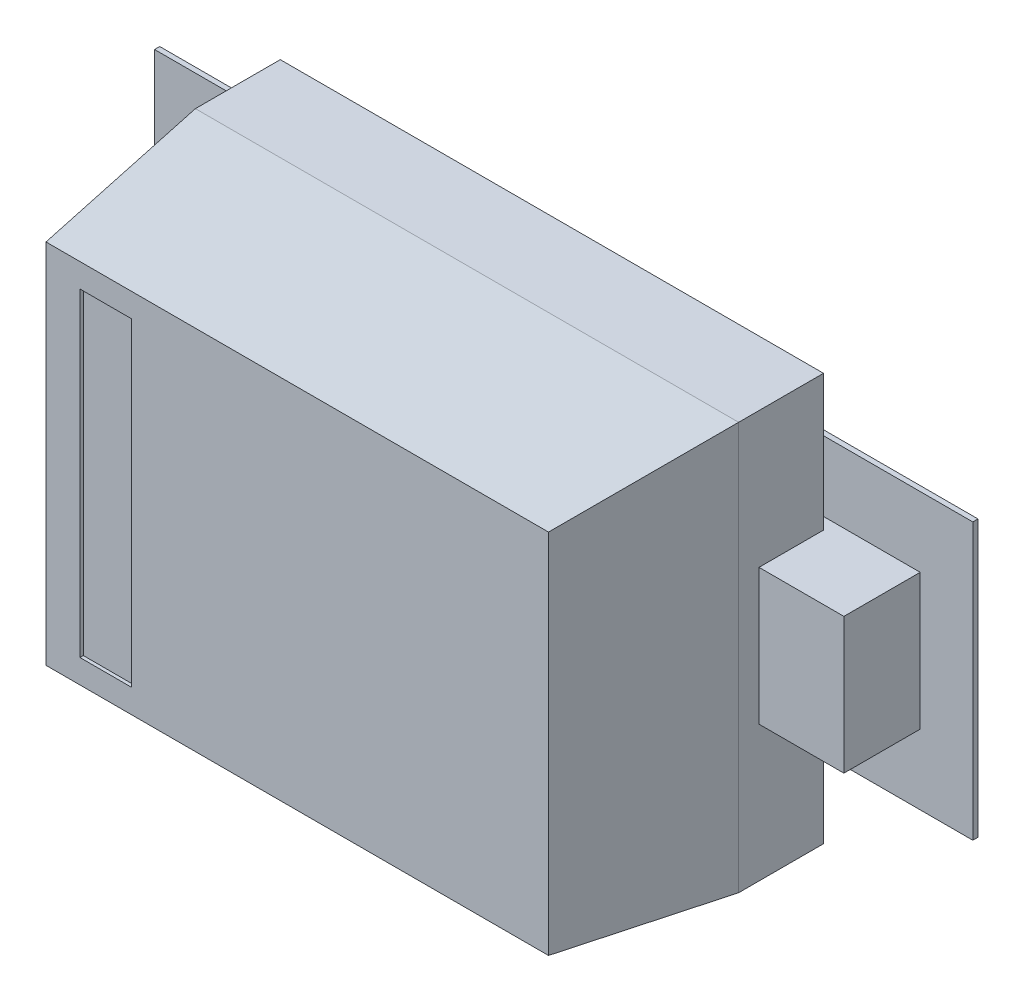
ISO-10303-21;
HEADER;
FILE_DESCRIPTION(('STEP AP214'),'2;1');
FILE_NAME('part.step','',(''),(''),'','','');
FILE_SCHEMA(('AUTOMOTIVE_DESIGN { 1 0 10303 214 1 1 1 1 }'));
ENDSEC;
DATA;
#1=APPLICATION_CONTEXT('core data for automotive mechanical design processes');
#2=APPLICATION_PROTOCOL_DEFINITION('international standard','automotive_design',2000,#1);
#3=PRODUCT_CONTEXT('',#1,'mechanical');
#4=PRODUCT('Part','Part','',(#3));
#5=PRODUCT_RELATED_PRODUCT_CATEGORY('part','',(#4));
#6=PRODUCT_DEFINITION_FORMATION('','',#4);
#7=PRODUCT_DEFINITION_CONTEXT('part definition',#1,'design');
#8=PRODUCT_DEFINITION('design','',#6,#7);
#9=PRODUCT_DEFINITION_SHAPE('','',#8);
#10=(LENGTH_UNIT() NAMED_UNIT(*) SI_UNIT(.MILLI.,.METRE.));
#11=(NAMED_UNIT(*) PLANE_ANGLE_UNIT() SI_UNIT($,.RADIAN.));
#12=(NAMED_UNIT(*) SI_UNIT($,.STERADIAN.) SOLID_ANGLE_UNIT());
#13=UNCERTAINTY_MEASURE_WITH_UNIT(LENGTH_MEASURE(1.E-05),#10,'distance_accuracy_value','');
#14=(GEOMETRIC_REPRESENTATION_CONTEXT(3) GLOBAL_UNCERTAINTY_ASSIGNED_CONTEXT((#13)) GLOBAL_UNIT_ASSIGNED_CONTEXT((#10,
#11,#12)) REPRESENTATION_CONTEXT('',''));
#15=CARTESIAN_POINT('',(0.,0.,0.));
#16=DIRECTION('',(0.,0.,1.));
#17=DIRECTION('',(1.,0.,0.));
#18=AXIS2_PLACEMENT_3D('',#15,#16,#17);
#19=CARTESIAN_POINT('',(0.,-0.3,0.4712));
#20=DIRECTION('',(0.,0.,1.));
#21=DIRECTION('',(1.,0.,0.));
#22=AXIS2_PLACEMENT_3D('',#19,#20,#21);
#23=PLANE('',#22);
#24=DIRECTION('',(1.,0.,0.));
#25=VECTOR('',#24,1.);
#26=CARTESIAN_POINT('',(-0.32,-0.235,0.4712));
#27=LINE('',#26,#25);
#28=CARTESIAN_POINT('',(-0.32,-0.235,0.4712));
#29=VERTEX_POINT('',#28);
#30=CARTESIAN_POINT('',(-0.2438,-0.235,0.4712));
#31=VERTEX_POINT('',#30);
#32=EDGE_CURVE('E20',#29,#31,#27,.T.);
#33=ORIENTED_EDGE('',*,*,#32,.T.);
#34=DIRECTION('',(0.,1.,0.));
#35=VECTOR('',#34,1.);
#36=CARTESIAN_POINT('',(-0.2438,-0.235,0.4712));
#37=LINE('',#36,#35);
#38=CARTESIAN_POINT('',(-0.2438,0.235,0.4712));
#39=VERTEX_POINT('',#38);
#40=EDGE_CURVE('E236',#31,#39,#37,.T.);
#41=ORIENTED_EDGE('',*,*,#40,.T.);
#42=DIRECTION('',(1.,0.,0.));
#43=VECTOR('',#42,1.);
#44=CARTESIAN_POINT('',(-0.2438,0.235,0.4712));
#45=LINE('',#44,#43);
#46=CARTESIAN_POINT('',(-0.32,0.235,0.4712));
#47=VERTEX_POINT('',#46);
#48=EDGE_CURVE('E228',#39,#47,#45,.F.);
#49=ORIENTED_EDGE('',*,*,#48,.T.);
#50=DIRECTION('',(0.,1.,0.));
#51=VECTOR('',#50,1.);
#52=CARTESIAN_POINT('',(-0.32,0.235,0.4712));
#53=LINE('',#52,#51);
#54=EDGE_CURVE('E212',#47,#29,#53,.F.);
#55=ORIENTED_EDGE('',*,*,#54,.T.);
#56=EDGE_LOOP('',(#33,#41,#49,#55));
#57=FACE_BOUND('',#56,.T.);
#58=ADVANCED_FACE('F17',(#57),#23,.T.);
#59=CARTESIAN_POINT('',(-0.325,-0.1,0.0762));
#60=DIRECTION('',(0.,0.,-1.));
#61=DIRECTION('',(-1.,0.,0.));
#62=AXIS2_PLACEMENT_3D('',#59,#60,#61);
#63=PLANE('',#62);
#64=DIRECTION('',(0.,1.,0.));
#65=VECTOR('',#64,1.);
#66=CARTESIAN_POINT('',(0.2975102,0.2029968,0.0762));
#67=LINE('',#66,#65);
#68=CARTESIAN_POINT('',(0.2975102,0.2029968,0.0762));
#69=VERTEX_POINT('',#68);
#70=CARTESIAN_POINT('',(0.2975102,-0.2029968,0.0762));
#71=VERTEX_POINT('',#70);
#72=EDGE_CURVE('E241',#69,#71,#67,.F.);
#73=ORIENTED_EDGE('',*,*,#72,.F.);
#74=DIRECTION('',(1.,0.,0.));
#75=VECTOR('',#74,1.);
#76=CARTESIAN_POINT('',(0.602488,0.2029968,0.0762));
#77=LINE('',#76,#75);
#78=CARTESIAN_POINT('',(0.602488,0.2029968,0.0762));
#79=VERTEX_POINT('',#78);
#80=EDGE_CURVE('E258',#79,#69,#77,.F.);
#81=ORIENTED_EDGE('',*,*,#80,.F.);
#82=DIRECTION('',(0.,1.,0.));
#83=VECTOR('',#82,1.);
#84=CARTESIAN_POINT('',(0.602488,-0.2029968,0.0762));
#85=LINE('',#84,#83);
#86=CARTESIAN_POINT('',(0.602488,-0.2029968,0.0762));
#87=VERTEX_POINT('',#86);
#88=EDGE_CURVE('E251',#87,#79,#85,.T.);
#89=ORIENTED_EDGE('',*,*,#88,.F.);
#90=DIRECTION('',(1.,0.,0.));
#91=VECTOR('',#90,1.);
#92=CARTESIAN_POINT('',(0.2975102,-0.2029968,0.0762));
#93=LINE('',#92,#91);
#94=EDGE_CURVE('E246',#71,#87,#93,.T.);
#95=ORIENTED_EDGE('',*,*,#94,.F.);
#96=EDGE_LOOP('',(#73,#81,#89,#95));
#97=FACE_BOUND('',#96,.T.);
#98=ADVANCED_FACE('F612',(#97),#63,.T.);
#99=CARTESIAN_POINT('',(-0.32,-0.235,0.4762));
#100=DIRECTION('',(0.,-1.,0.));
#101=DIRECTION('',(0.,0.,-1.));
#102=AXIS2_PLACEMENT_3D('',#99,#100,#101);
#103=PLANE('',#102);
#104=ORIENTED_EDGE('',*,*,#32,.F.);
#105=DIRECTION('',(0.,0.,1.));
#106=VECTOR('',#105,1.);
#107=CARTESIAN_POINT('',(-0.32,-0.235,0.4762));
#108=LINE('',#107,#106);
#109=CARTESIAN_POINT('',(-0.32,-0.235,0.4762));
#110=VERTEX_POINT('',#109);
#111=EDGE_CURVE('E220',#29,#110,#108,.T.);
#112=ORIENTED_EDGE('',*,*,#111,.T.);
#113=DIRECTION('',(1.,0.,0.));
#114=VECTOR('',#113,1.);
#115=CARTESIAN_POINT('',(-0.4,-0.235,0.4762));
#116=LINE('',#115,#114);
#117=CARTESIAN_POINT('',(-0.2438,-0.235,0.4762));
#118=VERTEX_POINT('',#117);
#119=EDGE_CURVE('E261',#118,#110,#116,.F.);
#120=ORIENTED_EDGE('',*,*,#119,.F.);
#121=DIRECTION('',(0.,0.,-1.));
#122=VECTOR('',#121,1.);
#123=CARTESIAN_POINT('',(-0.2438,-0.235,0.4762));
#124=LINE('',#123,#122);
#125=EDGE_CURVE('E222',#118,#31,#124,.T.);
#126=ORIENTED_EDGE('',*,*,#125,.T.);
#127=EDGE_LOOP('',(#104,#112,#120,#126));
#128=FACE_BOUND('',#127,.T.);
#129=ADVANCED_FACE('F218',(#128),#103,.F.);
#130=CARTESIAN_POINT('',(-0.32,0.235,0.4762));
#131=DIRECTION('',(-1.,0.,0.));
#132=DIRECTION('',(0.,0.,1.));
#133=AXIS2_PLACEMENT_3D('',#130,#131,#132);
#134=PLANE('',#133);
#135=ORIENTED_EDGE('',*,*,#54,.F.);
#136=DIRECTION('',(0.,0.,1.));
#137=VECTOR('',#136,1.);
#138=CARTESIAN_POINT('',(-0.32,0.235,0.4762));
#139=LINE('',#138,#137);
#140=CARTESIAN_POINT('',(-0.32,0.235,0.4762));
#141=VERTEX_POINT('',#140);
#142=EDGE_CURVE('E233',#47,#141,#139,.T.);
#143=ORIENTED_EDGE('',*,*,#142,.T.);
#144=DIRECTION('',(0.,1.,0.));
#145=VECTOR('',#144,1.);
#146=CARTESIAN_POINT('',(-0.32,-0.3,0.4762));
#147=LINE('',#146,#145);
#148=EDGE_CURVE('E227',#110,#141,#147,.T.);
#149=ORIENTED_EDGE('',*,*,#148,.F.);
#150=ORIENTED_EDGE('',*,*,#111,.F.);
#151=EDGE_LOOP('',(#135,#143,#149,#150));
#152=FACE_BOUND('',#151,.T.);
#153=ADVANCED_FACE('F226',(#152),#134,.F.);
#154=CARTESIAN_POINT('',(-0.2438,0.235,0.4762));
#155=DIRECTION('',(0.,1.,0.));
#156=DIRECTION('',(0.,0.,1.));
#157=AXIS2_PLACEMENT_3D('',#154,#155,#156);
#158=PLANE('',#157);
#159=ORIENTED_EDGE('',*,*,#48,.F.);
#160=DIRECTION('',(0.,0.,-1.));
#161=VECTOR('',#160,1.);
#162=CARTESIAN_POINT('',(-0.2438,0.235,0.4762));
#163=LINE('',#162,#161);
#164=CARTESIAN_POINT('',(-0.2438,0.235,0.4762));
#165=VERTEX_POINT('',#164);
#166=EDGE_CURVE('E238',#39,#165,#163,.F.);
#167=ORIENTED_EDGE('',*,*,#166,.T.);
#168=DIRECTION('',(1.,0.,0.));
#169=VECTOR('',#168,1.);
#170=CARTESIAN_POINT('',(-0.4,0.235,0.4762));
#171=LINE('',#170,#169);
#172=EDGE_CURVE('E264',#141,#165,#171,.T.);
#173=ORIENTED_EDGE('',*,*,#172,.F.);
#174=ORIENTED_EDGE('',*,*,#142,.F.);
#175=EDGE_LOOP('',(#159,#167,#173,#174));
#176=FACE_BOUND('',#175,.T.);
#177=ADVANCED_FACE('F604',(#176),#158,.F.);
#178=CARTESIAN_POINT('',(-0.2438,-0.235,0.4762));
#179=DIRECTION('',(1.,0.,0.));
#180=DIRECTION('',(0.,0.,-1.));
#181=AXIS2_PLACEMENT_3D('',#178,#179,#180);
#182=PLANE('',#181);
#183=ORIENTED_EDGE('',*,*,#40,.F.);
#184=ORIENTED_EDGE('',*,*,#125,.F.);
#185=DIRECTION('',(0.,1.,0.));
#186=VECTOR('',#185,1.);
#187=CARTESIAN_POINT('',(-0.2438,-0.3,0.4762));
#188=LINE('',#187,#186);
#189=EDGE_CURVE('E266',#165,#118,#188,.F.);
#190=ORIENTED_EDGE('',*,*,#189,.F.);
#191=ORIENTED_EDGE('',*,*,#166,.F.);
#192=EDGE_LOOP('',(#183,#184,#190,#191));
#193=FACE_BOUND('',#192,.T.);
#194=ADVANCED_FACE('F600',(#193),#182,.F.);
#195=CARTESIAN_POINT('',(-0.325,-0.1,0.0762));
#196=DIRECTION('',(0.,0.,-1.));
#197=DIRECTION('',(-1.,0.,0.));
#198=AXIS2_PLACEMENT_3D('',#195,#196,#197);
#199=PLANE('',#198);
#200=DIRECTION('',(0.,1.,0.));
#201=VECTOR('',#200,1.);
#202=CARTESIAN_POINT('',(-0.602488,0.2029968,0.0762));
#203=LINE('',#202,#201);
#204=CARTESIAN_POINT('',(-0.602488,0.2029968,0.0762));
#205=VERTEX_POINT('',#204);
#206=CARTESIAN_POINT('',(-0.602488,-0.2029968,0.0762));
#207=VERTEX_POINT('',#206);
#208=EDGE_CURVE('E269',#205,#207,#203,.F.);
#209=ORIENTED_EDGE('',*,*,#208,.F.);
#210=DIRECTION('',(1.,0.,0.));
#211=VECTOR('',#210,1.);
#212=CARTESIAN_POINT('',(-0.2975102,0.2029968,0.0762));
#213=LINE('',#212,#211);
#214=CARTESIAN_POINT('',(-0.2975102,0.2029968,0.0762));
#215=VERTEX_POINT('',#214);
#216=EDGE_CURVE('E286',#215,#205,#213,.F.);
#217=ORIENTED_EDGE('',*,*,#216,.F.);
#218=DIRECTION('',(0.,1.,0.));
#219=VECTOR('',#218,1.);
#220=CARTESIAN_POINT('',(-0.2975102,-0.2029968,0.0762));
#221=LINE('',#220,#219);
#222=CARTESIAN_POINT('',(-0.2975102,-0.2029968,0.0762));
#223=VERTEX_POINT('',#222);
#224=EDGE_CURVE('E279',#223,#215,#221,.T.);
#225=ORIENTED_EDGE('',*,*,#224,.F.);
#226=DIRECTION('',(1.,0.,0.));
#227=VECTOR('',#226,1.);
#228=CARTESIAN_POINT('',(-0.602488,-0.2029968,0.0762));
#229=LINE('',#228,#227);
#230=EDGE_CURVE('E274',#207,#223,#229,.T.);
#231=ORIENTED_EDGE('',*,*,#230,.F.);
#232=EDGE_LOOP('',(#209,#217,#225,#231));
#233=FACE_BOUND('',#232,.T.);
#234=ADVANCED_FACE('F596',(#233),#199,.T.);
#235=CARTESIAN_POINT('',(0.2975102,0.2029968,0.0762));
#236=DIRECTION('',(-1.,0.,0.));
#237=DIRECTION('',(0.,0.,1.));
#238=AXIS2_PLACEMENT_3D('',#235,#236,#237);
#239=PLANE('',#238);
#240=DIRECTION('',(0.,0.,1.));
#241=VECTOR('',#240,1.);
#242=CARTESIAN_POINT('',(0.2975102,0.2029968,0.0762));
#243=LINE('',#242,#241);
#244=CARTESIAN_POINT('',(0.2975102,0.2029968,0.08382));
#245=VERTEX_POINT('',#244);
#246=EDGE_CURVE('E253',#69,#245,#243,.T.);
#247=ORIENTED_EDGE('',*,*,#246,.F.);
#248=ORIENTED_EDGE('',*,*,#72,.T.);
#249=DIRECTION('',(0.,0.,-1.));
#250=VECTOR('',#249,1.);
#251=CARTESIAN_POINT('',(0.2975102,-0.2029968,0.0762));
#252=LINE('',#251,#250);
#253=CARTESIAN_POINT('',(0.2975102,-0.2029968,0.08382));
#254=VERTEX_POINT('',#253);
#255=EDGE_CURVE('E243',#254,#71,#252,.T.);
#256=ORIENTED_EDGE('',*,*,#255,.F.);
#257=DIRECTION('',(0.,1.,0.));
#258=VECTOR('',#257,1.);
#259=CARTESIAN_POINT('',(0.2975102,0.,0.08382));
#260=LINE('',#259,#258);
#261=EDGE_CURVE('E291',#245,#254,#260,.F.);
#262=ORIENTED_EDGE('',*,*,#261,.F.);
#263=EDGE_LOOP('',(#247,#248,#256,#262));
#264=FACE_BOUND('',#263,.T.);
#265=ADVANCED_FACE('F592',(#264),#239,.T.);
#266=CARTESIAN_POINT('',(0.2975102,-0.2029968,0.0762));
#267=DIRECTION('',(0.,-1.,0.));
#268=DIRECTION('',(0.,0.,-1.));
#269=AXIS2_PLACEMENT_3D('',#266,#267,#268);
#270=PLANE('',#269);
#271=ORIENTED_EDGE('',*,*,#255,.T.);
#272=ORIENTED_EDGE('',*,*,#94,.T.);
#273=DIRECTION('',(0.,0.,-1.));
#274=VECTOR('',#273,1.);
#275=CARTESIAN_POINT('',(0.602488,-0.2029968,0.0762));
#276=LINE('',#275,#274);
#277=CARTESIAN_POINT('',(0.602488,-0.2029968,0.08382));
#278=VERTEX_POINT('',#277);
#279=EDGE_CURVE('E248',#278,#87,#276,.T.);
#280=ORIENTED_EDGE('',*,*,#279,.F.);
#281=DIRECTION('',(1.,0.,0.));
#282=VECTOR('',#281,1.);
#283=CARTESIAN_POINT('',(0.,-0.2029968,0.08382));
#284=LINE('',#283,#282);
#285=EDGE_CURVE('E293',#254,#278,#284,.T.);
#286=ORIENTED_EDGE('',*,*,#285,.F.);
#287=EDGE_LOOP('',(#271,#272,#280,#286));
#288=FACE_BOUND('',#287,.T.);
#289=ADVANCED_FACE('F588',(#288),#270,.T.);
#290=CARTESIAN_POINT('',(0.602488,-0.2029968,0.0762));
#291=DIRECTION('',(1.,0.,0.));
#292=DIRECTION('',(0.,0.,-1.));
#293=AXIS2_PLACEMENT_3D('',#290,#291,#292);
#294=PLANE('',#293);
#295=ORIENTED_EDGE('',*,*,#279,.T.);
#296=ORIENTED_EDGE('',*,*,#88,.T.);
#297=DIRECTION('',(0.,0.,1.));
#298=VECTOR('',#297,1.);
#299=CARTESIAN_POINT('',(0.602488,0.2029968,0.0762));
#300=LINE('',#299,#298);
#301=CARTESIAN_POINT('',(0.602488,0.2029968,0.08382));
#302=VERTEX_POINT('',#301);
#303=EDGE_CURVE('E255',#302,#79,#300,.F.);
#304=ORIENTED_EDGE('',*,*,#303,.F.);
#305=DIRECTION('',(0.,1.,0.));
#306=VECTOR('',#305,1.);
#307=CARTESIAN_POINT('',(0.602488,0.,0.08382));
#308=LINE('',#307,#306);
#309=EDGE_CURVE('E295',#278,#302,#308,.T.);
#310=ORIENTED_EDGE('',*,*,#309,.F.);
#311=EDGE_LOOP('',(#295,#296,#304,#310));
#312=FACE_BOUND('',#311,.T.);
#313=ADVANCED_FACE('F584',(#312),#294,.T.);
#314=CARTESIAN_POINT('',(0.602488,0.2029968,0.0762));
#315=DIRECTION('',(0.,1.,0.));
#316=DIRECTION('',(0.,0.,1.));
#317=AXIS2_PLACEMENT_3D('',#314,#315,#316);
#318=PLANE('',#317);
#319=ORIENTED_EDGE('',*,*,#303,.T.);
#320=ORIENTED_EDGE('',*,*,#80,.T.);
#321=ORIENTED_EDGE('',*,*,#246,.T.);
#322=DIRECTION('',(1.,0.,0.));
#323=VECTOR('',#322,1.);
#324=CARTESIAN_POINT('',(0.,0.2029968,0.08382));
#325=LINE('',#324,#323);
#326=EDGE_CURVE('E297',#302,#245,#325,.F.);
#327=ORIENTED_EDGE('',*,*,#326,.F.);
#328=EDGE_LOOP('',(#319,#320,#321,#327));
#329=FACE_BOUND('',#328,.T.);
#330=ADVANCED_FACE('F580',(#329),#318,.T.);
#331=CARTESIAN_POINT('',(-0.4,-0.3,0.4762));
#332=DIRECTION('',(0.,0.,1.));
#333=DIRECTION('',(1.,0.,0.));
#334=AXIS2_PLACEMENT_3D('',#331,#332,#333);
#335=PLANE('',#334);
#336=ORIENTED_EDGE('',*,*,#172,.T.);
#337=ORIENTED_EDGE('',*,*,#189,.T.);
#338=ORIENTED_EDGE('',*,*,#119,.T.);
#339=ORIENTED_EDGE('',*,*,#148,.T.);
#340=EDGE_LOOP('',(#336,#337,#338,#339));
#341=FACE_BOUND('',#340,.T.);
#342=DIRECTION('',(0.,1.,0.));
#343=VECTOR('',#342,1.);
#344=CARTESIAN_POINT('',(-0.370000000000003,0.,0.476200000000001));
#345=LINE('',#344,#343);
#346=CARTESIAN_POINT('',(-0.370000000000001,-0.270000000000001,0.4762));
#347=VERTEX_POINT('',#346);
#348=CARTESIAN_POINT('',(-0.370000000000001,0.270000000000001,0.4762));
#349=VERTEX_POINT('',#348);
#350=EDGE_CURVE('E312',#347,#349,#345,.T.);
#351=ORIENTED_EDGE('',*,*,#350,.F.);
#352=DIRECTION('',(1.,0.,0.));
#353=VECTOR('',#352,1.);
#354=CARTESIAN_POINT('',(0.,-0.270000000000003,0.476200000000001));
#355=LINE('',#354,#353);
#356=CARTESIAN_POINT('',(0.370000000000001,-0.270000000000001,0.4762));
#357=VERTEX_POINT('',#356);
#358=EDGE_CURVE('E289',#357,#347,#355,.F.);
#359=ORIENTED_EDGE('',*,*,#358,.F.);
#360=DIRECTION('',(0.,1.,0.));
#361=VECTOR('',#360,1.);
#362=CARTESIAN_POINT('',(0.370000000000003,0.,0.476200000000001));
#363=LINE('',#362,#361);
#364=CARTESIAN_POINT('',(0.370000000000001,0.270000000000001,0.4762));
#365=VERTEX_POINT('',#364);
#366=EDGE_CURVE('E304',#365,#357,#363,.F.);
#367=ORIENTED_EDGE('',*,*,#366,.F.);
#368=DIRECTION('',(1.,0.,0.));
#369=VECTOR('',#368,1.);
#370=CARTESIAN_POINT('',(0.,0.270000000000003,0.476200000000001));
#371=LINE('',#370,#369);
#372=EDGE_CURVE('E308',#349,#365,#371,.T.);
#373=ORIENTED_EDGE('',*,*,#372,.F.);
#374=EDGE_LOOP('',(#351,#359,#367,#373));
#375=FACE_BOUND('',#374,.T.);
#376=ADVANCED_FACE('F576',(#341,#375),#335,.T.);
#377=CARTESIAN_POINT('',(-0.602488,0.2029968,0.0762));
#378=DIRECTION('',(-1.,0.,0.));
#379=DIRECTION('',(0.,0.,1.));
#380=AXIS2_PLACEMENT_3D('',#377,#378,#379);
#381=PLANE('',#380);
#382=DIRECTION('',(0.,0.,1.));
#383=VECTOR('',#382,1.);
#384=CARTESIAN_POINT('',(-0.602488,0.2029968,0.0762));
#385=LINE('',#384,#383);
#386=CARTESIAN_POINT('',(-0.602488,0.2029968,0.08382));
#387=VERTEX_POINT('',#386);
#388=EDGE_CURVE('E281',#205,#387,#385,.T.);
#389=ORIENTED_EDGE('',*,*,#388,.F.);
#390=ORIENTED_EDGE('',*,*,#208,.T.);
#391=DIRECTION('',(0.,0.,-1.));
#392=VECTOR('',#391,1.);
#393=CARTESIAN_POINT('',(-0.602488,-0.2029968,0.0762));
#394=LINE('',#393,#392);
#395=CARTESIAN_POINT('',(-0.602488,-0.2029968,0.08382));
#396=VERTEX_POINT('',#395);
#397=EDGE_CURVE('E271',#396,#207,#394,.T.);
#398=ORIENTED_EDGE('',*,*,#397,.F.);
#399=DIRECTION('',(0.,1.,0.));
#400=VECTOR('',#399,1.);
#401=CARTESIAN_POINT('',(-0.602488,0.,0.08382));
#402=LINE('',#401,#400);
#403=EDGE_CURVE('E321',#387,#396,#402,.F.);
#404=ORIENTED_EDGE('',*,*,#403,.F.);
#405=EDGE_LOOP('',(#389,#390,#398,#404));
#406=FACE_BOUND('',#405,.T.);
#407=ADVANCED_FACE('F572',(#406),#381,.T.);
#408=CARTESIAN_POINT('',(-0.602488,-0.2029968,0.0762));
#409=DIRECTION('',(0.,-1.,0.));
#410=DIRECTION('',(0.,0.,-1.));
#411=AXIS2_PLACEMENT_3D('',#408,#409,#410);
#412=PLANE('',#411);
#413=ORIENTED_EDGE('',*,*,#397,.T.);
#414=ORIENTED_EDGE('',*,*,#230,.T.);
#415=DIRECTION('',(0.,0.,-1.));
#416=VECTOR('',#415,1.);
#417=CARTESIAN_POINT('',(-0.2975102,-0.2029968,0.0762));
#418=LINE('',#417,#416);
#419=CARTESIAN_POINT('',(-0.2975102,-0.2029968,0.08382));
#420=VERTEX_POINT('',#419);
#421=EDGE_CURVE('E276',#420,#223,#418,.T.);
#422=ORIENTED_EDGE('',*,*,#421,.F.);
#423=DIRECTION('',(1.,0.,0.));
#424=VECTOR('',#423,1.);
#425=CARTESIAN_POINT('',(0.,-0.2029968,0.08382));
#426=LINE('',#425,#424);
#427=EDGE_CURVE('E323',#396,#420,#426,.T.);
#428=ORIENTED_EDGE('',*,*,#427,.F.);
#429=EDGE_LOOP('',(#413,#414,#422,#428));
#430=FACE_BOUND('',#429,.T.);
#431=ADVANCED_FACE('F568',(#430),#412,.T.);
#432=CARTESIAN_POINT('',(-0.2975102,-0.2029968,0.0762));
#433=DIRECTION('',(1.,0.,0.));
#434=DIRECTION('',(0.,0.,-1.));
#435=AXIS2_PLACEMENT_3D('',#432,#433,#434);
#436=PLANE('',#435);
#437=ORIENTED_EDGE('',*,*,#421,.T.);
#438=ORIENTED_EDGE('',*,*,#224,.T.);
#439=DIRECTION('',(0.,0.,1.));
#440=VECTOR('',#439,1.);
#441=CARTESIAN_POINT('',(-0.2975102,0.2029968,0.0762));
#442=LINE('',#441,#440);
#443=CARTESIAN_POINT('',(-0.2975102,0.2029968,0.08382));
#444=VERTEX_POINT('',#443);
#445=EDGE_CURVE('E283',#444,#215,#442,.F.);
#446=ORIENTED_EDGE('',*,*,#445,.F.);
#447=DIRECTION('',(0.,1.,0.));
#448=VECTOR('',#447,1.);
#449=CARTESIAN_POINT('',(-0.2975102,0.,0.08382));
#450=LINE('',#449,#448);
#451=EDGE_CURVE('E325',#420,#444,#450,.T.);
#452=ORIENTED_EDGE('',*,*,#451,.F.);
#453=EDGE_LOOP('',(#437,#438,#446,#452));
#454=FACE_BOUND('',#453,.T.);
#455=ADVANCED_FACE('F564',(#454),#436,.T.);
#456=CARTESIAN_POINT('',(-0.2975102,0.2029968,0.0762));
#457=DIRECTION('',(0.,1.,0.));
#458=DIRECTION('',(0.,0.,1.));
#459=AXIS2_PLACEMENT_3D('',#456,#457,#458);
#460=PLANE('',#459);
#461=ORIENTED_EDGE('',*,*,#445,.T.);
#462=ORIENTED_EDGE('',*,*,#216,.T.);
#463=ORIENTED_EDGE('',*,*,#388,.T.);
#464=DIRECTION('',(1.,0.,0.));
#465=VECTOR('',#464,1.);
#466=CARTESIAN_POINT('',(0.,0.2029968,0.08382));
#467=LINE('',#466,#465);
#468=EDGE_CURVE('E327',#444,#387,#467,.F.);
#469=ORIENTED_EDGE('',*,*,#468,.F.);
#470=EDGE_LOOP('',(#461,#462,#463,#469));
#471=FACE_BOUND('',#470,.T.);
#472=ADVANCED_FACE('F560',(#471),#460,.T.);
#473=CARTESIAN_POINT('',(0.,-0.285,0.3512));
#474=DIRECTION('',(0.,-0.992876838486925,0.119145220618403));
#475=DIRECTION('',(0.,-0.119145220618403,-0.992876838486925));
#476=AXIS2_PLACEMENT_3D('',#473,#474,#475);
#477=PLANE('',#476);
#478=DIRECTION('',(0.118308451008737,-0.118308451008765,-0.985903758406377));
#479=VECTOR('',#478,1.);
#480=CARTESIAN_POINT('',(0.370000000000003,-0.27,0.476200000000001));
#481=LINE('',#480,#479);
#482=CARTESIAN_POINT('',(0.4,-0.299999999999998,0.2262));
#483=VERTEX_POINT('',#482);
#484=EDGE_CURVE('E306',#357,#483,#481,.T.);
#485=ORIENTED_EDGE('',*,*,#484,.F.);
#486=ORIENTED_EDGE('',*,*,#358,.T.);
#487=DIRECTION('',(0.118308451008737,0.118308451008765,0.985903758406377));
#488=VECTOR('',#487,1.);
#489=CARTESIAN_POINT('',(-0.399999999999997,-0.3,0.2262));
#490=LINE('',#489,#488);
#491=CARTESIAN_POINT('',(-0.399999999999999,-0.299999999999998,0.2262));
#492=VERTEX_POINT('',#491);
#493=EDGE_CURVE('E316',#492,#347,#490,.T.);
#494=ORIENTED_EDGE('',*,*,#493,.F.);
#495=DIRECTION('',(1.,0.,0.));
#496=VECTOR('',#495,1.);
#497=CARTESIAN_POINT('',(0.,-0.3,0.2262));
#498=LINE('',#497,#496);
#499=EDGE_CURVE('E341',#492,#483,#498,.T.);
#500=ORIENTED_EDGE('',*,*,#499,.T.);
#501=EDGE_LOOP('',(#485,#486,#494,#500));
#502=FACE_BOUND('',#501,.T.);
#503=ADVANCED_FACE('F556',(#502),#477,.T.);
#504=CARTESIAN_POINT('',(0.525,-0.1,0.1962));
#505=DIRECTION('',(1.,0.,0.));
#506=DIRECTION('',(0.,0.,-1.));
#507=AXIS2_PLACEMENT_3D('',#504,#505,#506);
#508=PLANE('',#507);
#509=DIRECTION('',(0.,0.,1.));
#510=VECTOR('',#509,1.);
#511=CARTESIAN_POINT('',(0.525,-0.1,0.));
#512=LINE('',#511,#510);
#513=CARTESIAN_POINT('',(0.525,-0.1,0.1962));
#514=VERTEX_POINT('',#513);
#515=CARTESIAN_POINT('',(0.525,-0.1,0.08382));
#516=VERTEX_POINT('',#515);
#517=EDGE_CURVE('E349',#514,#516,#512,.F.);
#518=ORIENTED_EDGE('',*,*,#517,.T.);
#519=DIRECTION('',(0.,1.,0.));
#520=VECTOR('',#519,1.);
#521=CARTESIAN_POINT('',(0.525,0.,0.08382));
#522=LINE('',#521,#520);
#523=CARTESIAN_POINT('',(0.525,0.1,0.08382));
#524=VERTEX_POINT('',#523);
#525=EDGE_CURVE('E300',#524,#516,#522,.F.);
#526=ORIENTED_EDGE('',*,*,#525,.F.);
#527=DIRECTION('',(0.,0.,1.));
#528=VECTOR('',#527,1.);
#529=CARTESIAN_POINT('',(0.525,0.1,0.));
#530=LINE('',#529,#528);
#531=CARTESIAN_POINT('',(0.525,0.1,0.1962));
#532=VERTEX_POINT('',#531);
#533=EDGE_CURVE('E362',#532,#524,#530,.F.);
#534=ORIENTED_EDGE('',*,*,#533,.F.);
#535=DIRECTION('',(0.,1.,0.));
#536=VECTOR('',#535,1.);
#537=CARTESIAN_POINT('',(0.525,-0.1,0.1962));
#538=LINE('',#537,#536);
#539=EDGE_CURVE('E302',#514,#532,#538,.T.);
#540=ORIENTED_EDGE('',*,*,#539,.F.);
#541=EDGE_LOOP('',(#518,#526,#534,#540));
#542=FACE_BOUND('',#541,.T.);
#543=ADVANCED_FACE('F552',(#542),#508,.T.);
#544=CARTESIAN_POINT('',(0.,0.,0.08382));
#545=DIRECTION('',(0.,0.,1.));
#546=DIRECTION('',(1.,0.,0.));
#547=AXIS2_PLACEMENT_3D('',#544,#545,#546);
#548=PLANE('',#547);
#549=ORIENTED_EDGE('',*,*,#525,.T.);
#550=DIRECTION('',(1.,0.,0.));
#551=VECTOR('',#550,1.);
#552=CARTESIAN_POINT('',(0.,-0.1,0.08382));
#553=LINE('',#552,#551);
#554=CARTESIAN_POINT('',(0.325,-0.1,0.08382));
#555=VERTEX_POINT('',#554);
#556=EDGE_CURVE('E344',#516,#555,#553,.F.);
#557=ORIENTED_EDGE('',*,*,#556,.T.);
#558=DIRECTION('',(0.,1.,0.));
#559=VECTOR('',#558,1.);
#560=CARTESIAN_POINT('',(0.325,-0.1,0.08382));
#561=LINE('',#560,#559);
#562=CARTESIAN_POINT('',(0.325,0.1,0.08382));
#563=VERTEX_POINT('',#562);
#564=EDGE_CURVE('E354',#563,#555,#561,.F.);
#565=ORIENTED_EDGE('',*,*,#564,.F.);
#566=DIRECTION('',(1.,0.,0.));
#567=VECTOR('',#566,1.);
#568=CARTESIAN_POINT('',(0.,0.1,0.08382));
#569=LINE('',#568,#567);
#570=EDGE_CURVE('E364',#524,#563,#569,.F.);
#571=ORIENTED_EDGE('',*,*,#570,.F.);
#572=EDGE_LOOP('',(#549,#557,#565,#571));
#573=FACE_BOUND('',#572,.T.);
#574=ORIENTED_EDGE('',*,*,#309,.T.);
#575=ORIENTED_EDGE('',*,*,#326,.T.);
#576=ORIENTED_EDGE('',*,*,#261,.T.);
#577=ORIENTED_EDGE('',*,*,#285,.T.);
#578=EDGE_LOOP('',(#574,#575,#576,#577));
#579=FACE_BOUND('',#578,.T.);
#580=ADVANCED_FACE('F548',(#573,#579),#548,.T.);
#581=CARTESIAN_POINT('',(0.325,-0.1,0.1962));
#582=DIRECTION('',(0.,0.,1.));
#583=DIRECTION('',(1.,0.,0.));
#584=AXIS2_PLACEMENT_3D('',#581,#582,#583);
#585=PLANE('',#584);
#586=DIRECTION('',(0.,1.,0.));
#587=VECTOR('',#586,1.);
#588=CARTESIAN_POINT('',(0.4,-0.3,0.1962));
#589=LINE('',#588,#587);
#590=CARTESIAN_POINT('',(0.4,-0.1,0.1962));
#591=VERTEX_POINT('',#590);
#592=CARTESIAN_POINT('',(0.4,0.1,0.1962));
#593=VERTEX_POINT('',#592);
#594=EDGE_CURVE('E372',#591,#593,#589,.T.);
#595=ORIENTED_EDGE('',*,*,#594,.F.);
#596=DIRECTION('',(1.,0.,0.));
#597=VECTOR('',#596,1.);
#598=CARTESIAN_POINT('',(0.,-0.1,0.1962));
#599=LINE('',#598,#597);
#600=EDGE_CURVE('E346',#591,#514,#599,.T.);
#601=ORIENTED_EDGE('',*,*,#600,.T.);
#602=ORIENTED_EDGE('',*,*,#539,.T.);
#603=DIRECTION('',(1.,0.,0.));
#604=VECTOR('',#603,1.);
#605=CARTESIAN_POINT('',(0.,0.1,0.1962));
#606=LINE('',#605,#604);
#607=EDGE_CURVE('E359',#593,#532,#606,.T.);
#608=ORIENTED_EDGE('',*,*,#607,.F.);
#609=EDGE_LOOP('',(#595,#601,#602,#608));
#610=FACE_BOUND('',#609,.T.);
#611=ADVANCED_FACE('F544',(#610),#585,.T.);
#612=CARTESIAN_POINT('',(0.385,0.,0.3512));
#613=DIRECTION('',(0.992876838486925,0.,0.119145220618403));
#614=DIRECTION('',(0.119145220618403,0.,-0.992876838486925));
#615=AXIS2_PLACEMENT_3D('',#612,#613,#614);
#616=PLANE('',#615);
#617=ORIENTED_EDGE('',*,*,#484,.T.);
#618=DIRECTION('',(0.,1.,0.));
#619=VECTOR('',#618,1.);
#620=CARTESIAN_POINT('',(0.4,-0.3,0.2262));
#621=LINE('',#620,#619);
#622=CARTESIAN_POINT('',(0.399999999999998,0.3,0.2262));
#623=VERTEX_POINT('',#622);
#624=EDGE_CURVE('E376',#623,#483,#621,.F.);
#625=ORIENTED_EDGE('',*,*,#624,.F.);
#626=DIRECTION('',(0.118308451008765,0.118308451008737,-0.985903758406377));
#627=VECTOR('',#626,1.);
#628=CARTESIAN_POINT('',(0.37,0.270000000000003,0.476200000000001));
#629=LINE('',#628,#627);
#630=EDGE_CURVE('E310',#365,#623,#629,.T.);
#631=ORIENTED_EDGE('',*,*,#630,.F.);
#632=ORIENTED_EDGE('',*,*,#366,.T.);
#633=EDGE_LOOP('',(#617,#625,#631,#632));
#634=FACE_BOUND('',#633,.T.);
#635=ADVANCED_FACE('F540',(#634),#616,.T.);
#636=CARTESIAN_POINT('',(0.,0.285,0.3512));
#637=DIRECTION('',(0.,0.992876838486925,0.119145220618403));
#638=DIRECTION('',(0.,-0.119145220618403,0.992876838486925));
#639=AXIS2_PLACEMENT_3D('',#636,#637,#638);
#640=PLANE('',#639);
#641=ORIENTED_EDGE('',*,*,#630,.T.);
#642=DIRECTION('',(1.,0.,0.));
#643=VECTOR('',#642,1.);
#644=CARTESIAN_POINT('',(0.,0.3,0.2262));
#645=LINE('',#644,#643);
#646=CARTESIAN_POINT('',(-0.399999999999999,0.299999999999998,0.2262));
#647=VERTEX_POINT('',#646);
#648=EDGE_CURVE('E381',#647,#623,#645,.T.);
#649=ORIENTED_EDGE('',*,*,#648,.F.);
#650=DIRECTION('',(-0.118308451008737,0.118308451008765,-0.985903758406377));
#651=VECTOR('',#650,1.);
#652=CARTESIAN_POINT('',(-0.370000000000003,0.27,0.476200000000001));
#653=LINE('',#652,#651);
#654=EDGE_CURVE('E314',#349,#647,#653,.T.);
#655=ORIENTED_EDGE('',*,*,#654,.F.);
#656=ORIENTED_EDGE('',*,*,#372,.T.);
#657=EDGE_LOOP('',(#641,#649,#655,#656));
#658=FACE_BOUND('',#657,.T.);
#659=ADVANCED_FACE('F536',(#658),#640,.T.);
#660=CARTESIAN_POINT('',(-0.385,0.,0.3512));
#661=DIRECTION('',(-0.992876838486925,0.,0.119145220618403));
#662=DIRECTION('',(0.119145220618403,0.,0.992876838486925));
#663=AXIS2_PLACEMENT_3D('',#660,#661,#662);
#664=PLANE('',#663);
#665=DIRECTION('',(0.,1.,0.));
#666=VECTOR('',#665,1.);
#667=CARTESIAN_POINT('',(-0.4,-0.3,0.2262));
#668=LINE('',#667,#666);
#669=EDGE_CURVE('E384',#492,#647,#668,.T.);
#670=ORIENTED_EDGE('',*,*,#669,.F.);
#671=ORIENTED_EDGE('',*,*,#493,.T.);
#672=ORIENTED_EDGE('',*,*,#350,.T.);
#673=ORIENTED_EDGE('',*,*,#654,.T.);
#674=EDGE_LOOP('',(#670,#671,#672,#673));
#675=FACE_BOUND('',#674,.T.);
#676=ADVANCED_FACE('F532',(#675),#664,.T.);
#677=CARTESIAN_POINT('',(-0.525,-0.1,0.0762));
#678=DIRECTION('',(-1.,0.,0.));
#679=DIRECTION('',(0.,0.,1.));
#680=AXIS2_PLACEMENT_3D('',#677,#678,#679);
#681=PLANE('',#680);
#682=DIRECTION('',(0.,0.,1.));
#683=VECTOR('',#682,1.);
#684=CARTESIAN_POINT('',(-0.525,0.1,0.));
#685=LINE('',#684,#683);
#686=CARTESIAN_POINT('',(-0.525,0.1,0.08382));
#687=VERTEX_POINT('',#686);
#688=CARTESIAN_POINT('',(-0.525,0.1,0.1962));
#689=VERTEX_POINT('',#688);
#690=EDGE_CURVE('E396',#687,#689,#685,.T.);
#691=ORIENTED_EDGE('',*,*,#690,.F.);
#692=DIRECTION('',(0.,1.,0.));
#693=VECTOR('',#692,1.);
#694=CARTESIAN_POINT('',(-0.525,0.,0.08382));
#695=LINE('',#694,#693);
#696=CARTESIAN_POINT('',(-0.525,-0.1,0.08382));
#697=VERTEX_POINT('',#696);
#698=EDGE_CURVE('E330',#697,#687,#695,.T.);
#699=ORIENTED_EDGE('',*,*,#698,.F.);
#700=DIRECTION('',(0.,0.,1.));
#701=VECTOR('',#700,1.);
#702=CARTESIAN_POINT('',(-0.525,-0.1,0.));
#703=LINE('',#702,#701);
#704=CARTESIAN_POINT('',(-0.525,-0.1,0.1962));
#705=VERTEX_POINT('',#704);
#706=EDGE_CURVE('E335',#697,#705,#703,.T.);
#707=ORIENTED_EDGE('',*,*,#706,.T.);
#708=DIRECTION('',(0.,1.,0.));
#709=VECTOR('',#708,1.);
#710=CARTESIAN_POINT('',(-0.525,-0.1,0.1962));
#711=LINE('',#710,#709);
#712=EDGE_CURVE('E319',#689,#705,#711,.F.);
#713=ORIENTED_EDGE('',*,*,#712,.F.);
#714=EDGE_LOOP('',(#691,#699,#707,#713));
#715=FACE_BOUND('',#714,.T.);
#716=ADVANCED_FACE('F528',(#715),#681,.T.);
#717=CARTESIAN_POINT('',(-0.525,-0.1,0.1962));
#718=DIRECTION('',(0.,0.,1.));
#719=DIRECTION('',(1.,0.,0.));
#720=AXIS2_PLACEMENT_3D('',#717,#718,#719);
#721=PLANE('',#720);
#722=ORIENTED_EDGE('',*,*,#712,.T.);
#723=DIRECTION('',(1.,0.,0.));
#724=VECTOR('',#723,1.);
#725=CARTESIAN_POINT('',(0.,-0.1,0.1962));
#726=LINE('',#725,#724);
#727=CARTESIAN_POINT('',(-0.4,-0.1,0.1962));
#728=VERTEX_POINT('',#727);
#729=EDGE_CURVE('E338',#705,#728,#726,.T.);
#730=ORIENTED_EDGE('',*,*,#729,.T.);
#731=DIRECTION('',(0.,1.,0.));
#732=VECTOR('',#731,1.);
#733=CARTESIAN_POINT('',(-0.4,-0.3,0.1962));
#734=LINE('',#733,#732);
#735=CARTESIAN_POINT('',(-0.4,0.1,0.1962));
#736=VERTEX_POINT('',#735);
#737=EDGE_CURVE('E389',#736,#728,#734,.F.);
#738=ORIENTED_EDGE('',*,*,#737,.F.);
#739=DIRECTION('',(1.,0.,0.));
#740=VECTOR('',#739,1.);
#741=CARTESIAN_POINT('',(0.,0.1,0.1962));
#742=LINE('',#741,#740);
#743=EDGE_CURVE('E398',#689,#736,#742,.T.);
#744=ORIENTED_EDGE('',*,*,#743,.F.);
#745=EDGE_LOOP('',(#722,#730,#738,#744));
#746=FACE_BOUND('',#745,.T.);
#747=ADVANCED_FACE('F524',(#746),#721,.T.);
#748=CARTESIAN_POINT('',(0.,0.,0.08382));
#749=DIRECTION('',(0.,0.,1.));
#750=DIRECTION('',(1.,0.,0.));
#751=AXIS2_PLACEMENT_3D('',#748,#749,#750);
#752=PLANE('',#751);
#753=DIRECTION('',(0.,1.,0.));
#754=VECTOR('',#753,1.);
#755=CARTESIAN_POINT('',(-0.325,-0.1,0.08382));
#756=LINE('',#755,#754);
#757=CARTESIAN_POINT('',(-0.325,-0.1,0.08382));
#758=VERTEX_POINT('',#757);
#759=CARTESIAN_POINT('',(-0.325,0.1,0.08382));
#760=VERTEX_POINT('',#759);
#761=EDGE_CURVE('E409',#758,#760,#756,.T.);
#762=ORIENTED_EDGE('',*,*,#761,.F.);
#763=DIRECTION('',(1.,0.,0.));
#764=VECTOR('',#763,1.);
#765=CARTESIAN_POINT('',(0.,-0.1,0.08382));
#766=LINE('',#765,#764);
#767=EDGE_CURVE('E332',#758,#697,#766,.F.);
#768=ORIENTED_EDGE('',*,*,#767,.T.);
#769=ORIENTED_EDGE('',*,*,#698,.T.);
#770=DIRECTION('',(1.,0.,0.));
#771=VECTOR('',#770,1.);
#772=CARTESIAN_POINT('',(0.,0.1,0.08382));
#773=LINE('',#772,#771);
#774=EDGE_CURVE('E402',#760,#687,#773,.F.);
#775=ORIENTED_EDGE('',*,*,#774,.F.);
#776=EDGE_LOOP('',(#762,#768,#769,#775));
#777=FACE_BOUND('',#776,.T.);
#778=ORIENTED_EDGE('',*,*,#451,.T.);
#779=ORIENTED_EDGE('',*,*,#468,.T.);
#780=ORIENTED_EDGE('',*,*,#403,.T.);
#781=ORIENTED_EDGE('',*,*,#427,.T.);
#782=EDGE_LOOP('',(#778,#779,#780,#781));
#783=FACE_BOUND('',#782,.T.);
#784=ADVANCED_FACE('F521',(#777,#783),#752,.T.);
#785=CARTESIAN_POINT('',(0.,-0.1,0.));
#786=DIRECTION('',(0.,1.,0.));
#787=DIRECTION('',(0.,0.,1.));
#788=AXIS2_PLACEMENT_3D('',#785,#786,#787);
#789=PLANE('',#788);
#790=DIRECTION('',(1.,0.,0.));
#791=VECTOR('',#790,1.);
#792=CARTESIAN_POINT('',(-0.41,-0.1,0.1012));
#793=LINE('',#792,#791);
#794=CARTESIAN_POINT('',(-0.325,-0.1,0.1012));
#795=VERTEX_POINT('',#794);
#796=CARTESIAN_POINT('',(-0.4,-0.1,0.1012));
#797=VERTEX_POINT('',#796);
#798=EDGE_CURVE('E411',#795,#797,#793,.F.);
#799=ORIENTED_EDGE('',*,*,#798,.T.);
#800=DIRECTION('',(0.,0.,1.));
#801=VECTOR('',#800,1.);
#802=CARTESIAN_POINT('',(-0.4,-0.1,0.0762));
#803=LINE('',#802,#801);
#804=EDGE_CURVE('E391',#728,#797,#803,.F.);
#805=ORIENTED_EDGE('',*,*,#804,.F.);
#806=ORIENTED_EDGE('',*,*,#729,.F.);
#807=ORIENTED_EDGE('',*,*,#706,.F.);
#808=ORIENTED_EDGE('',*,*,#767,.F.);
#809=DIRECTION('',(0.,0.,-1.));
#810=VECTOR('',#809,1.);
#811=CARTESIAN_POINT('',(-0.325,-0.1,0.1962));
#812=LINE('',#811,#810);
#813=EDGE_CURVE('E406',#795,#758,#812,.T.);
#814=ORIENTED_EDGE('',*,*,#813,.F.);
#815=EDGE_LOOP('',(#799,#805,#806,#807,#808,#814));
#816=FACE_BOUND('',#815,.T.);
#817=ADVANCED_FACE('F490',(#816),#789,.F.);
#818=CARTESIAN_POINT('',(0.,-0.3,0.));
#819=DIRECTION('',(0.,1.,0.));
#820=DIRECTION('',(0.,0.,1.));
#821=AXIS2_PLACEMENT_3D('',#818,#819,#820);
#822=PLANE('',#821);
#823=DIRECTION('',(1.,0.,0.));
#824=VECTOR('',#823,1.);
#825=CARTESIAN_POINT('',(-0.41,-0.3,0.1012));
#826=LINE('',#825,#824);
#827=CARTESIAN_POINT('',(-0.4,-0.3,0.1012));
#828=VERTEX_POINT('',#827);
#829=CARTESIAN_POINT('',(0.4,-0.3,0.1012));
#830=VERTEX_POINT('',#829);
#831=EDGE_CURVE('E417',#828,#830,#826,.T.);
#832=ORIENTED_EDGE('',*,*,#831,.T.);
#833=DIRECTION('',(0.,0.,-1.));
#834=VECTOR('',#833,1.);
#835=CARTESIAN_POINT('',(0.4,-0.3,0.4762));
#836=LINE('',#835,#834);
#837=EDGE_CURVE('E367',#483,#830,#836,.T.);
#838=ORIENTED_EDGE('',*,*,#837,.F.);
#839=ORIENTED_EDGE('',*,*,#499,.F.);
#840=DIRECTION('',(0.,0.,1.));
#841=VECTOR('',#840,1.);
#842=CARTESIAN_POINT('',(-0.4,-0.3,0.0762));
#843=LINE('',#842,#841);
#844=EDGE_CURVE('E393',#828,#492,#843,.T.);
#845=ORIENTED_EDGE('',*,*,#844,.F.);
#846=EDGE_LOOP('',(#832,#838,#839,#845));
#847=FACE_BOUND('',#846,.T.);
#848=ADVANCED_FACE('F483',(#847),#822,.F.);
#849=CARTESIAN_POINT('',(0.,-0.1,0.));
#850=DIRECTION('',(0.,1.,0.));
#851=DIRECTION('',(0.,0.,1.));
#852=AXIS2_PLACEMENT_3D('',#849,#850,#851);
#853=PLANE('',#852);
#854=ORIENTED_EDGE('',*,*,#600,.F.);
#855=DIRECTION('',(0.,0.,-1.));
#856=VECTOR('',#855,1.);
#857=CARTESIAN_POINT('',(0.4,-0.1,0.4762));
#858=LINE('',#857,#856);
#859=CARTESIAN_POINT('',(0.4,-0.1,0.1012));
#860=VERTEX_POINT('',#859);
#861=EDGE_CURVE('E369',#860,#591,#858,.F.);
#862=ORIENTED_EDGE('',*,*,#861,.F.);
#863=DIRECTION('',(1.,0.,0.));
#864=VECTOR('',#863,1.);
#865=CARTESIAN_POINT('',(-0.41,-0.1,0.1012));
#866=LINE('',#865,#864);
#867=CARTESIAN_POINT('',(0.325,-0.1,0.1012));
#868=VERTEX_POINT('',#867);
#869=EDGE_CURVE('E423',#860,#868,#866,.F.);
#870=ORIENTED_EDGE('',*,*,#869,.T.);
#871=DIRECTION('',(0.,0.,1.));
#872=VECTOR('',#871,1.);
#873=CARTESIAN_POINT('',(0.325,-0.1,0.0762));
#874=LINE('',#873,#872);
#875=EDGE_CURVE('E352',#555,#868,#874,.T.);
#876=ORIENTED_EDGE('',*,*,#875,.F.);
#877=ORIENTED_EDGE('',*,*,#556,.F.);
#878=ORIENTED_EDGE('',*,*,#517,.F.);
#879=EDGE_LOOP('',(#854,#862,#870,#876,#877,#878));
#880=FACE_BOUND('',#879,.T.);
#881=ADVANCED_FACE('F476',(#880),#853,.F.);
#882=CARTESIAN_POINT('',(0.325,-0.1,0.0762));
#883=DIRECTION('',(-1.,0.,0.));
#884=DIRECTION('',(0.,0.,1.));
#885=AXIS2_PLACEMENT_3D('',#882,#883,#884);
#886=PLANE('',#885);
#887=DIRECTION('',(0.,0.,1.));
#888=VECTOR('',#887,1.);
#889=CARTESIAN_POINT('',(0.325,0.1,0.));
#890=LINE('',#889,#888);
#891=CARTESIAN_POINT('',(0.325,0.1,0.1012));
#892=VERTEX_POINT('',#891);
#893=EDGE_CURVE('E357',#563,#892,#890,.T.);
#894=ORIENTED_EDGE('',*,*,#893,.F.);
#895=ORIENTED_EDGE('',*,*,#564,.T.);
#896=ORIENTED_EDGE('',*,*,#875,.T.);
#897=DIRECTION('',(0.,1.,0.));
#898=VECTOR('',#897,1.);
#899=CARTESIAN_POINT('',(0.325,-0.3302,0.1012));
#900=LINE('',#899,#898);
#901=EDGE_CURVE('E426',#868,#892,#900,.T.);
#902=ORIENTED_EDGE('',*,*,#901,.T.);
#903=EDGE_LOOP('',(#894,#895,#896,#902));
#904=FACE_BOUND('',#903,.T.);
#905=ADVANCED_FACE('F472',(#904),#886,.T.);
#906=CARTESIAN_POINT('',(0.,0.1,0.));
#907=DIRECTION('',(0.,1.,0.));
#908=DIRECTION('',(0.,0.,1.));
#909=AXIS2_PLACEMENT_3D('',#906,#907,#908);
#910=PLANE('',#909);
#911=ORIENTED_EDGE('',*,*,#533,.T.);
#912=ORIENTED_EDGE('',*,*,#570,.T.);
#913=ORIENTED_EDGE('',*,*,#893,.T.);
#914=DIRECTION('',(1.,0.,0.));
#915=VECTOR('',#914,1.);
#916=CARTESIAN_POINT('',(-0.41,0.1,0.1012));
#917=LINE('',#916,#915);
#918=CARTESIAN_POINT('',(0.4,0.1,0.1012));
#919=VERTEX_POINT('',#918);
#920=EDGE_CURVE('E429',#892,#919,#917,.T.);
#921=ORIENTED_EDGE('',*,*,#920,.T.);
#922=DIRECTION('',(0.,0.,-1.));
#923=VECTOR('',#922,1.);
#924=CARTESIAN_POINT('',(0.4,0.1,0.4762));
#925=LINE('',#924,#923);
#926=EDGE_CURVE('E374',#593,#919,#925,.T.);
#927=ORIENTED_EDGE('',*,*,#926,.F.);
#928=ORIENTED_EDGE('',*,*,#607,.T.);
#929=EDGE_LOOP('',(#911,#912,#913,#921,#927,#928));
#930=FACE_BOUND('',#929,.T.);
#931=ADVANCED_FACE('F466',(#930),#910,.T.);
#932=CARTESIAN_POINT('',(0.4,-0.3,0.4762));
#933=DIRECTION('',(1.,0.,0.));
#934=DIRECTION('',(0.,0.,-1.));
#935=AXIS2_PLACEMENT_3D('',#932,#933,#934);
#936=PLANE('',#935);
#937=DIRECTION('',(0.,0.,1.));
#938=VECTOR('',#937,1.);
#939=CARTESIAN_POINT('',(0.4,0.3,0.));
#940=LINE('',#939,#938);
#941=CARTESIAN_POINT('',(0.4,0.3,0.1012));
#942=VERTEX_POINT('',#941);
#943=EDGE_CURVE('E379',#623,#942,#940,.F.);
#944=ORIENTED_EDGE('',*,*,#943,.F.);
#945=ORIENTED_EDGE('',*,*,#624,.T.);
#946=ORIENTED_EDGE('',*,*,#837,.T.);
#947=DIRECTION('',(0.,1.,0.));
#948=VECTOR('',#947,1.);
#949=CARTESIAN_POINT('',(0.4,-0.3302,0.1012));
#950=LINE('',#949,#948);
#951=EDGE_CURVE('E420',#830,#860,#950,.T.);
#952=ORIENTED_EDGE('',*,*,#951,.T.);
#953=ORIENTED_EDGE('',*,*,#861,.T.);
#954=ORIENTED_EDGE('',*,*,#594,.T.);
#955=ORIENTED_EDGE('',*,*,#926,.T.);
#956=DIRECTION('',(0.,1.,0.));
#957=VECTOR('',#956,1.);
#958=CARTESIAN_POINT('',(0.4,-0.3302,0.1012));
#959=LINE('',#958,#957);
#960=EDGE_CURVE('E432',#919,#942,#959,.T.);
#961=ORIENTED_EDGE('',*,*,#960,.T.);
#962=EDGE_LOOP('',(#944,#945,#946,#952,#953,#954,#955,#961));
#963=FACE_BOUND('',#962,.T.);
#964=ADVANCED_FACE('F461',(#963),#936,.T.);
#965=CARTESIAN_POINT('',(0.,0.3,0.));
#966=DIRECTION('',(0.,1.,0.));
#967=DIRECTION('',(0.,0.,1.));
#968=AXIS2_PLACEMENT_3D('',#965,#966,#967);
#969=PLANE('',#968);
#970=DIRECTION('',(0.,0.,1.));
#971=VECTOR('',#970,1.);
#972=CARTESIAN_POINT('',(-0.4,0.3,0.0762));
#973=LINE('',#972,#971);
#974=CARTESIAN_POINT('',(-0.4,0.3,0.1012));
#975=VERTEX_POINT('',#974);
#976=EDGE_CURVE('E387',#647,#975,#973,.F.);
#977=ORIENTED_EDGE('',*,*,#976,.F.);
#978=ORIENTED_EDGE('',*,*,#648,.T.);
#979=ORIENTED_EDGE('',*,*,#943,.T.);
#980=DIRECTION('',(1.,0.,0.));
#981=VECTOR('',#980,1.);
#982=CARTESIAN_POINT('',(-0.41,0.3,0.1012));
#983=LINE('',#982,#981);
#984=EDGE_CURVE('E435',#942,#975,#983,.F.);
#985=ORIENTED_EDGE('',*,*,#984,.T.);
#986=EDGE_LOOP('',(#977,#978,#979,#985));
#987=FACE_BOUND('',#986,.T.);
#988=ADVANCED_FACE('F456',(#987),#969,.T.);
#989=CARTESIAN_POINT('',(-0.4,-0.3,0.0762));
#990=DIRECTION('',(-1.,0.,0.));
#991=DIRECTION('',(0.,0.,1.));
#992=AXIS2_PLACEMENT_3D('',#989,#990,#991);
#993=PLANE('',#992);
#994=DIRECTION('',(0.,1.,0.));
#995=VECTOR('',#994,1.);
#996=CARTESIAN_POINT('',(-0.4,-0.3302,0.1012));
#997=LINE('',#996,#995);
#998=EDGE_CURVE('E414',#797,#828,#997,.F.);
#999=ORIENTED_EDGE('',*,*,#998,.T.);
#1000=ORIENTED_EDGE('',*,*,#844,.T.);
#1001=ORIENTED_EDGE('',*,*,#669,.T.);
#1002=ORIENTED_EDGE('',*,*,#976,.T.);
#1003=DIRECTION('',(0.,1.,0.));
#1004=VECTOR('',#1003,1.);
#1005=CARTESIAN_POINT('',(-0.4,-0.3302,0.1012));
#1006=LINE('',#1005,#1004);
#1007=CARTESIAN_POINT('',(-0.4,0.1,0.1012));
#1008=VERTEX_POINT('',#1007);
#1009=EDGE_CURVE('E438',#975,#1008,#1006,.F.);
#1010=ORIENTED_EDGE('',*,*,#1009,.T.);
#1011=DIRECTION('',(0.,0.,1.));
#1012=VECTOR('',#1011,1.);
#1013=CARTESIAN_POINT('',(-0.4,0.1,0.));
#1014=LINE('',#1013,#1012);
#1015=EDGE_CURVE('E400',#736,#1008,#1014,.F.);
#1016=ORIENTED_EDGE('',*,*,#1015,.F.);
#1017=ORIENTED_EDGE('',*,*,#737,.T.);
#1018=ORIENTED_EDGE('',*,*,#804,.T.);
#1019=EDGE_LOOP('',(#999,#1000,#1001,#1002,#1010,#1016,#1017,#1018));
#1020=FACE_BOUND('',#1019,.T.);
#1021=ADVANCED_FACE('F451',(#1020),#993,.T.);
#1022=CARTESIAN_POINT('',(0.,0.1,0.));
#1023=DIRECTION('',(0.,1.,0.));
#1024=DIRECTION('',(0.,0.,1.));
#1025=AXIS2_PLACEMENT_3D('',#1022,#1023,#1024);
#1026=PLANE('',#1025);
#1027=DIRECTION('',(0.,0.,-1.));
#1028=VECTOR('',#1027,1.);
#1029=CARTESIAN_POINT('',(-0.325,0.1,0.1962));
#1030=LINE('',#1029,#1028);
#1031=CARTESIAN_POINT('',(-0.325,0.1,0.1012));
#1032=VERTEX_POINT('',#1031);
#1033=EDGE_CURVE('E34',#760,#1032,#1030,.F.);
#1034=ORIENTED_EDGE('',*,*,#1033,.F.);
#1035=ORIENTED_EDGE('',*,*,#774,.T.);
#1036=ORIENTED_EDGE('',*,*,#690,.T.);
#1037=ORIENTED_EDGE('',*,*,#743,.T.);
#1038=ORIENTED_EDGE('',*,*,#1015,.T.);
#1039=DIRECTION('',(1.,0.,0.));
#1040=VECTOR('',#1039,1.);
#1041=CARTESIAN_POINT('',(-0.41,0.1,0.1012));
#1042=LINE('',#1041,#1040);
#1043=EDGE_CURVE('E26',#1008,#1032,#1042,.T.);
#1044=ORIENTED_EDGE('',*,*,#1043,.T.);
#1045=EDGE_LOOP('',(#1034,#1035,#1036,#1037,#1038,#1044));
#1046=FACE_BOUND('',#1045,.T.);
#1047=ADVANCED_FACE('F444',(#1046),#1026,.T.);
#1048=CARTESIAN_POINT('',(-0.325,-0.1,0.1962));
#1049=DIRECTION('',(1.,0.,0.));
#1050=DIRECTION('',(0.,0.,-1.));
#1051=AXIS2_PLACEMENT_3D('',#1048,#1049,#1050);
#1052=PLANE('',#1051);
#1053=ORIENTED_EDGE('',*,*,#813,.T.);
#1054=ORIENTED_EDGE('',*,*,#761,.T.);
#1055=ORIENTED_EDGE('',*,*,#1033,.T.);
#1056=DIRECTION('',(0.,1.,0.));
#1057=VECTOR('',#1056,1.);
#1058=CARTESIAN_POINT('',(-0.325,-0.3302,0.1012));
#1059=LINE('',#1058,#1057);
#1060=EDGE_CURVE('E11',#1032,#795,#1059,.F.);
#1061=ORIENTED_EDGE('',*,*,#1060,.T.);
#1062=EDGE_LOOP('',(#1053,#1054,#1055,#1061));
#1063=FACE_BOUND('',#1062,.T.);
#1064=ADVANCED_FACE('F494',(#1063),#1052,.T.);
#1065=CARTESIAN_POINT('',(-0.41,-0.3302,0.1012));
#1066=DIRECTION('',(0.,0.,1.));
#1067=DIRECTION('',(1.,0.,0.));
#1068=AXIS2_PLACEMENT_3D('',#1065,#1066,#1067);
#1069=PLANE('',#1068);
#1070=ORIENTED_EDGE('',*,*,#1043,.F.);
#1071=ORIENTED_EDGE('',*,*,#1009,.F.);
#1072=ORIENTED_EDGE('',*,*,#984,.F.);
#1073=ORIENTED_EDGE('',*,*,#960,.F.);
#1074=ORIENTED_EDGE('',*,*,#920,.F.);
#1075=ORIENTED_EDGE('',*,*,#901,.F.);
#1076=ORIENTED_EDGE('',*,*,#869,.F.);
#1077=ORIENTED_EDGE('',*,*,#951,.F.);
#1078=ORIENTED_EDGE('',*,*,#831,.F.);
#1079=ORIENTED_EDGE('',*,*,#998,.F.);
#1080=ORIENTED_EDGE('',*,*,#798,.F.);
#1081=ORIENTED_EDGE('',*,*,#1060,.F.);
#1082=EDGE_LOOP('',(#1070,#1071,#1072,#1073,#1074,#1075,#1076,#1077,#1078,#1079,#1080,#1081));
#1083=FACE_BOUND('',#1082,.T.);
#1084=ADVANCED_FACE('F448',(#1083),#1069,.F.);
#1085=CLOSED_SHELL('',(#58,#98,#129,#153,#177,#194,#234,#265,#289,#313,#330,#376,#407,#431,#455,
#472,#503,#543,#580,#611,#635,#659,#676,#716,#747,#784,#817,#848,#881,#905,#931,#964,#988,#1021,
#1047,#1064,#1084));
#1086=MANIFOLD_SOLID_BREP('B1',#1085);
#1087=ADVANCED_BREP_SHAPE_REPRESENTATION('',(#18,#1086),#14);
#1088=SHAPE_DEFINITION_REPRESENTATION(#9,#1087);
ENDSEC;
END-ISO-10303-21;
